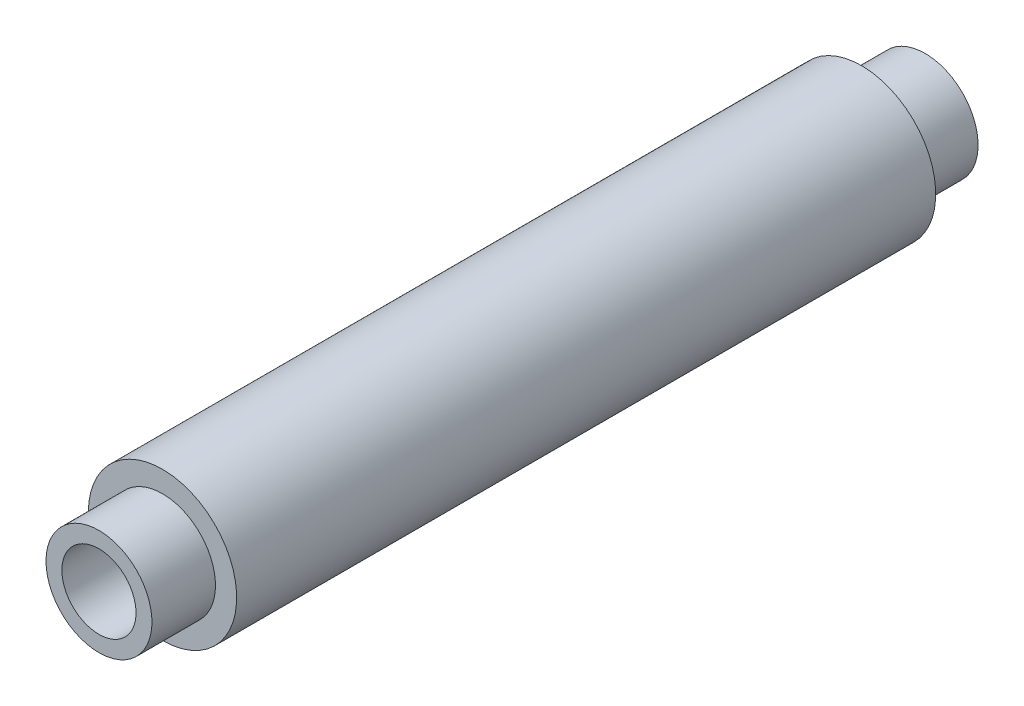
ISO-10303-21;
HEADER;
FILE_DESCRIPTION(('STEP AP214'),'2;1');
FILE_NAME('part.step','',(''),(''),'','','');
FILE_SCHEMA(('AUTOMOTIVE_DESIGN { 1 0 10303 214 1 1 1 1 }'));
ENDSEC;
DATA;
#1=APPLICATION_CONTEXT('core data for automotive mechanical design processes');
#2=APPLICATION_PROTOCOL_DEFINITION('international standard','automotive_design',2000,#1);
#3=PRODUCT_CONTEXT('',#1,'mechanical');
#4=PRODUCT('Part','Part','',(#3));
#5=PRODUCT_RELATED_PRODUCT_CATEGORY('part','',(#4));
#6=PRODUCT_DEFINITION_FORMATION('','',#4);
#7=PRODUCT_DEFINITION_CONTEXT('part definition',#1,'design');
#8=PRODUCT_DEFINITION('design','',#6,#7);
#9=PRODUCT_DEFINITION_SHAPE('','',#8);
#10=(LENGTH_UNIT() NAMED_UNIT(*) SI_UNIT(.MILLI.,.METRE.));
#11=(NAMED_UNIT(*) PLANE_ANGLE_UNIT() SI_UNIT($,.RADIAN.));
#12=(NAMED_UNIT(*) SI_UNIT($,.STERADIAN.) SOLID_ANGLE_UNIT());
#13=UNCERTAINTY_MEASURE_WITH_UNIT(LENGTH_MEASURE(1.E-05),#10,'distance_accuracy_value','');
#14=(GEOMETRIC_REPRESENTATION_CONTEXT(3) GLOBAL_UNCERTAINTY_ASSIGNED_CONTEXT((#13)) GLOBAL_UNIT_ASSIGNED_CONTEXT((#10,
#11,#12)) REPRESENTATION_CONTEXT('',''));
#15=CARTESIAN_POINT('',(0.,0.,0.));
#16=DIRECTION('',(0.,0.,1.));
#17=DIRECTION('',(1.,0.,0.));
#18=AXIS2_PLACEMENT_3D('',#15,#16,#17);
#19=CARTESIAN_POINT('',(2.5,0.,-19.5));
#20=DIRECTION('',(0.,0.,1.));
#21=DIRECTION('',(1.,0.,0.));
#22=AXIS2_PLACEMENT_3D('',#19,#20,#21);
#23=PLANE('',#22);
#24=CARTESIAN_POINT('',(0.,0.,-19.5));
#25=DIRECTION('',(0.,0.,-1.));
#26=DIRECTION('',(-1.,0.,0.));
#27=AXIS2_PLACEMENT_3D('',#24,#25,#26);
#28=CIRCLE('',#27,2.5);
#29=CARTESIAN_POINT('',(-2.5,0.,-19.5));
#30=VERTEX_POINT('',#29);
#31=EDGE_CURVE('E10',#30,#30,#28,.T.);
#32=ORIENTED_EDGE('',*,*,#31,.T.);
#33=EDGE_LOOP('',(#32));
#34=FACE_BOUND('',#33,.T.);
#35=CARTESIAN_POINT('',(0.,0.,-19.5));
#36=DIRECTION('',(0.,0.,1.));
#37=DIRECTION('',(1.,0.,0.));
#38=AXIS2_PLACEMENT_3D('',#35,#36,#37);
#39=CIRCLE('',#38,1.75);
#40=CARTESIAN_POINT('',(1.75,0.,-19.5));
#41=VERTEX_POINT('',#40);
#42=EDGE_CURVE('E57',#41,#41,#39,.F.);
#43=ORIENTED_EDGE('',*,*,#42,.F.);
#44=EDGE_LOOP('',(#43));
#45=FACE_BOUND('',#44,.T.);
#46=ADVANCED_FACE('F32',(#34,#45),#23,.F.);
#47=CARTESIAN_POINT('',(0.,0.,-21.3766459475115));
#48=DIRECTION('',(0.,0.,-1.));
#49=DIRECTION('',(-1.,0.,0.));
#50=AXIS2_PLACEMENT_3D('',#47,#48,#49);
#51=CYLINDRICAL_SURFACE('',#50,2.5);
#52=ORIENTED_EDGE('',*,*,#31,.F.);
#53=EDGE_LOOP('',(#52));
#54=FACE_BOUND('',#53,.T.);
#55=CARTESIAN_POINT('',(0.,0.,-16.5));
#56=DIRECTION('',(0.,0.,-1.));
#57=DIRECTION('',(-1.,0.,0.));
#58=AXIS2_PLACEMENT_3D('',#55,#56,#57);
#59=CIRCLE('',#58,2.5);
#60=CARTESIAN_POINT('',(-2.5,0.,-16.5));
#61=VERTEX_POINT('',#60);
#62=EDGE_CURVE('E38',#61,#61,#59,.T.);
#63=ORIENTED_EDGE('',*,*,#62,.T.);
#64=EDGE_LOOP('',(#63));
#65=FACE_BOUND('',#64,.T.);
#66=ADVANCED_FACE('F94',(#54,#65),#51,.T.);
#67=CARTESIAN_POINT('',(2.5,0.,-16.5));
#68=DIRECTION('',(0.,0.,1.));
#69=DIRECTION('',(1.,0.,0.));
#70=AXIS2_PLACEMENT_3D('',#67,#68,#69);
#71=PLANE('',#70);
#72=ORIENTED_EDGE('',*,*,#62,.F.);
#73=EDGE_LOOP('',(#72));
#74=FACE_BOUND('',#73,.T.);
#75=CARTESIAN_POINT('',(0.,0.,-16.5));
#76=DIRECTION('',(0.,0.,-1.));
#77=DIRECTION('',(-1.,0.,0.));
#78=AXIS2_PLACEMENT_3D('',#75,#76,#77);
#79=CIRCLE('',#78,3.5);
#80=CARTESIAN_POINT('',(-3.5,0.,-16.5));
#81=VERTEX_POINT('',#80);
#82=EDGE_CURVE('E42',#81,#81,#79,.T.);
#83=ORIENTED_EDGE('',*,*,#82,.T.);
#84=EDGE_LOOP('',(#83));
#85=FACE_BOUND('',#84,.T.);
#86=ADVANCED_FACE('F98',(#74,#85),#71,.F.);
#87=CARTESIAN_POINT('',(0.,0.,-21.3766459475115));
#88=DIRECTION('',(0.,0.,-1.));
#89=DIRECTION('',(-1.,0.,0.));
#90=AXIS2_PLACEMENT_3D('',#87,#88,#89);
#91=CYLINDRICAL_SURFACE('',#90,3.5);
#92=ORIENTED_EDGE('',*,*,#82,.F.);
#93=EDGE_LOOP('',(#92));
#94=FACE_BOUND('',#93,.T.);
#95=CARTESIAN_POINT('',(0.,0.,16.5));
#96=DIRECTION('',(0.,0.,-1.));
#97=DIRECTION('',(-1.,0.,0.));
#98=AXIS2_PLACEMENT_3D('',#95,#96,#97);
#99=CIRCLE('',#98,3.5);
#100=CARTESIAN_POINT('',(-3.5,0.,16.5));
#101=VERTEX_POINT('',#100);
#102=EDGE_CURVE('E46',#101,#101,#99,.T.);
#103=ORIENTED_EDGE('',*,*,#102,.T.);
#104=EDGE_LOOP('',(#103));
#105=FACE_BOUND('',#104,.T.);
#106=ADVANCED_FACE('F105',(#94,#105),#91,.T.);
#107=CARTESIAN_POINT('',(3.5,0.,16.5));
#108=DIRECTION('',(0.,0.,-1.));
#109=DIRECTION('',(-1.,0.,0.));
#110=AXIS2_PLACEMENT_3D('',#107,#108,#109);
#111=PLANE('',#110);
#112=ORIENTED_EDGE('',*,*,#102,.F.);
#113=EDGE_LOOP('',(#112));
#114=FACE_BOUND('',#113,.T.);
#115=CARTESIAN_POINT('',(0.,0.,16.5));
#116=DIRECTION('',(0.,0.,-1.));
#117=DIRECTION('',(-1.,0.,0.));
#118=AXIS2_PLACEMENT_3D('',#115,#116,#117);
#119=CIRCLE('',#118,2.5);
#120=CARTESIAN_POINT('',(-2.5,0.,16.5));
#121=VERTEX_POINT('',#120);
#122=EDGE_CURVE('E51',#121,#121,#119,.T.);
#123=ORIENTED_EDGE('',*,*,#122,.T.);
#124=EDGE_LOOP('',(#123));
#125=FACE_BOUND('',#124,.T.);
#126=ADVANCED_FACE('F111',(#114,#125),#111,.F.);
#127=CARTESIAN_POINT('',(0.,0.,-21.3766459475115));
#128=DIRECTION('',(0.,0.,-1.));
#129=DIRECTION('',(-1.,0.,0.));
#130=AXIS2_PLACEMENT_3D('',#127,#128,#129);
#131=CYLINDRICAL_SURFACE('',#130,2.5);
#132=ORIENTED_EDGE('',*,*,#122,.F.);
#133=EDGE_LOOP('',(#132));
#134=FACE_BOUND('',#133,.T.);
#135=CARTESIAN_POINT('',(0.,0.,19.5));
#136=DIRECTION('',(0.,0.,-1.));
#137=DIRECTION('',(-1.,0.,0.));
#138=AXIS2_PLACEMENT_3D('',#135,#136,#137);
#139=CIRCLE('',#138,2.5);
#140=CARTESIAN_POINT('',(-2.5,0.,19.5));
#141=VERTEX_POINT('',#140);
#142=EDGE_CURVE('E54',#141,#141,#139,.T.);
#143=ORIENTED_EDGE('',*,*,#142,.T.);
#144=EDGE_LOOP('',(#143));
#145=FACE_BOUND('',#144,.T.);
#146=ADVANCED_FACE('F90',(#134,#145),#131,.T.);
#147=CARTESIAN_POINT('',(2.5,0.,19.5));
#148=DIRECTION('',(0.,0.,-1.));
#149=DIRECTION('',(-1.,0.,0.));
#150=AXIS2_PLACEMENT_3D('',#147,#148,#149);
#151=PLANE('',#150);
#152=CARTESIAN_POINT('',(0.,0.,19.5));
#153=DIRECTION('',(0.,0.,-1.));
#154=DIRECTION('',(-1.,0.,0.));
#155=AXIS2_PLACEMENT_3D('',#152,#153,#154);
#156=CIRCLE('',#155,1.75);
#157=CARTESIAN_POINT('',(-1.75,0.,19.5));
#158=VERTEX_POINT('',#157);
#159=EDGE_CURVE('E58',#158,#158,#156,.T.);
#160=ORIENTED_EDGE('',*,*,#159,.T.);
#161=EDGE_LOOP('',(#160));
#162=FACE_BOUND('',#161,.T.);
#163=ORIENTED_EDGE('',*,*,#142,.F.);
#164=EDGE_LOOP('',(#163));
#165=FACE_BOUND('',#164,.T.);
#166=ADVANCED_FACE('F81',(#162,#165),#151,.F.);
#167=CARTESIAN_POINT('',(0.,0.,-21.3766459475115));
#168=DIRECTION('',(0.,0.,-1.));
#169=DIRECTION('',(-1.,0.,0.));
#170=AXIS2_PLACEMENT_3D('',#167,#168,#169);
#171=CYLINDRICAL_SURFACE('',#170,1.75);
#172=ORIENTED_EDGE('',*,*,#42,.T.);
#173=EDGE_LOOP('',(#172));
#174=FACE_BOUND('',#173,.T.);
#175=CARTESIAN_POINT('',(0.,0.,-15.75));
#176=DIRECTION('',(0.,0.,1.));
#177=DIRECTION('',(1.,0.,0.));
#178=AXIS2_PLACEMENT_3D('',#175,#176,#177);
#179=CIRCLE('',#178,1.75);
#180=CARTESIAN_POINT('',(1.75,0.,-15.75));
#181=VERTEX_POINT('',#180);
#182=EDGE_CURVE('E64',#181,#181,#179,.F.);
#183=ORIENTED_EDGE('',*,*,#182,.F.);
#184=EDGE_LOOP('',(#183));
#185=FACE_BOUND('',#184,.T.);
#186=ADVANCED_FACE('F79',(#174,#185),#171,.F.);
#187=CARTESIAN_POINT('',(2.5,0.,-15.75));
#188=DIRECTION('',(0.,0.,1.));
#189=DIRECTION('',(1.,0.,0.));
#190=AXIS2_PLACEMENT_3D('',#187,#188,#189);
#191=PLANE('',#190);
#192=ORIENTED_EDGE('',*,*,#182,.T.);
#193=EDGE_LOOP('',(#192));
#194=FACE_BOUND('',#193,.T.);
#195=CARTESIAN_POINT('',(0.,0.,-15.75));
#196=DIRECTION('',(0.,0.,1.));
#197=DIRECTION('',(1.,0.,0.));
#198=AXIS2_PLACEMENT_3D('',#195,#196,#197);
#199=CIRCLE('',#198,2.75);
#200=CARTESIAN_POINT('',(2.75,0.,-15.75));
#201=VERTEX_POINT('',#200);
#202=EDGE_CURVE('E70',#201,#201,#199,.F.);
#203=ORIENTED_EDGE('',*,*,#202,.F.);
#204=EDGE_LOOP('',(#203));
#205=FACE_BOUND('',#204,.T.);
#206=ADVANCED_FACE('F76',(#194,#205),#191,.T.);
#207=CARTESIAN_POINT('',(0.,0.,-21.3766459475115));
#208=DIRECTION('',(0.,0.,-1.));
#209=DIRECTION('',(-1.,0.,0.));
#210=AXIS2_PLACEMENT_3D('',#207,#208,#209);
#211=CYLINDRICAL_SURFACE('',#210,2.75);
#212=ORIENTED_EDGE('',*,*,#202,.T.);
#213=EDGE_LOOP('',(#212));
#214=FACE_BOUND('',#213,.T.);
#215=CARTESIAN_POINT('',(0.,0.,15.75));
#216=DIRECTION('',(0.,0.,-1.));
#217=DIRECTION('',(-1.,0.,0.));
#218=AXIS2_PLACEMENT_3D('',#215,#216,#217);
#219=CIRCLE('',#218,2.75);
#220=CARTESIAN_POINT('',(-2.75,0.,15.75));
#221=VERTEX_POINT('',#220);
#222=EDGE_CURVE('E67',#221,#221,#219,.T.);
#223=ORIENTED_EDGE('',*,*,#222,.F.);
#224=EDGE_LOOP('',(#223));
#225=FACE_BOUND('',#224,.T.);
#226=ADVANCED_FACE('F88',(#214,#225),#211,.F.);
#227=CARTESIAN_POINT('',(3.5,0.,15.75));
#228=DIRECTION('',(0.,0.,-1.));
#229=DIRECTION('',(-1.,0.,0.));
#230=AXIS2_PLACEMENT_3D('',#227,#228,#229);
#231=PLANE('',#230);
#232=ORIENTED_EDGE('',*,*,#222,.T.);
#233=EDGE_LOOP('',(#232));
#234=FACE_BOUND('',#233,.T.);
#235=CARTESIAN_POINT('',(0.,0.,15.75));
#236=DIRECTION('',(0.,0.,-1.));
#237=DIRECTION('',(-1.,0.,0.));
#238=AXIS2_PLACEMENT_3D('',#235,#236,#237);
#239=CIRCLE('',#238,1.75);
#240=CARTESIAN_POINT('',(-1.75,0.,15.75));
#241=VERTEX_POINT('',#240);
#242=EDGE_CURVE('E61',#241,#241,#239,.T.);
#243=ORIENTED_EDGE('',*,*,#242,.F.);
#244=EDGE_LOOP('',(#243));
#245=FACE_BOUND('',#244,.T.);
#246=ADVANCED_FACE('F122',(#234,#245),#231,.T.);
#247=CARTESIAN_POINT('',(0.,0.,-21.3766459475115));
#248=DIRECTION('',(0.,0.,-1.));
#249=DIRECTION('',(-1.,0.,0.));
#250=AXIS2_PLACEMENT_3D('',#247,#248,#249);
#251=CYLINDRICAL_SURFACE('',#250,1.75);
#252=ORIENTED_EDGE('',*,*,#242,.T.);
#253=EDGE_LOOP('',(#252));
#254=FACE_BOUND('',#253,.T.);
#255=ORIENTED_EDGE('',*,*,#159,.F.);
#256=EDGE_LOOP('',(#255));
#257=FACE_BOUND('',#256,.T.);
#258=ADVANCED_FACE('F119',(#254,#257),#251,.F.);
#259=CLOSED_SHELL('',(#46,#66,#86,#106,#126,#146,#166,#186,#206,#226,#246,#258));
#260=MANIFOLD_SOLID_BREP('B2',#259);
#261=ADVANCED_BREP_SHAPE_REPRESENTATION('',(#18,#260),#14);
#262=SHAPE_DEFINITION_REPRESENTATION(#9,#261);
ENDSEC;
END-ISO-10303-21;
